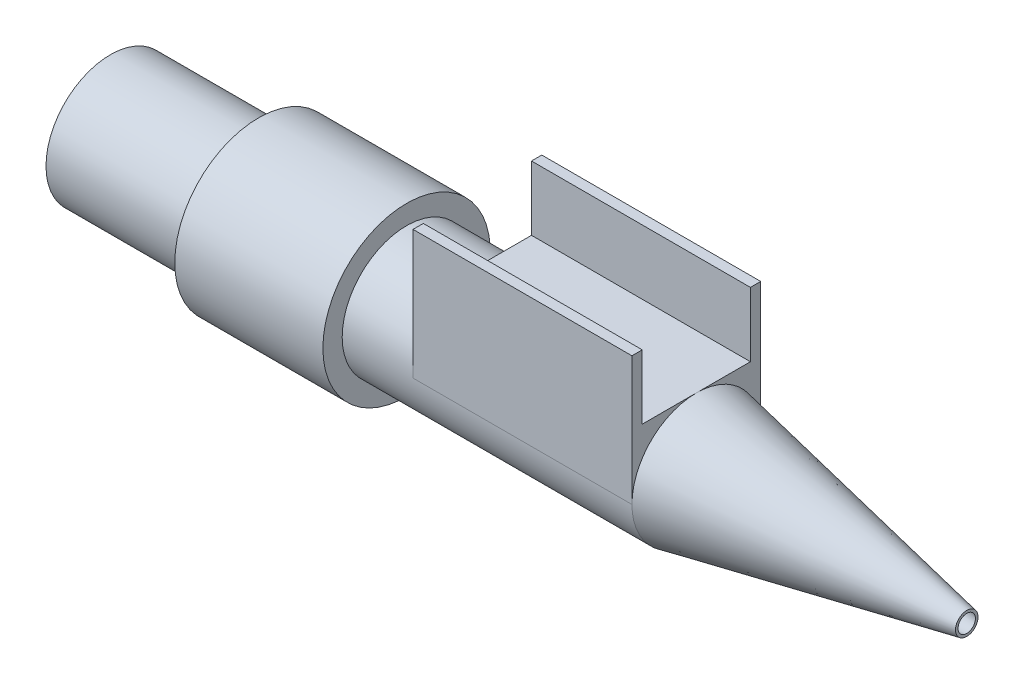
ISO-10303-21;
HEADER;
FILE_DESCRIPTION(('STEP AP214'),'2;1');
FILE_NAME('part.step','',(''),(''),'','','');
FILE_SCHEMA(('AUTOMOTIVE_DESIGN { 1 0 10303 214 1 1 1 1 }'));
ENDSEC;
DATA;
#1=APPLICATION_CONTEXT('core data for automotive mechanical design processes');
#2=APPLICATION_PROTOCOL_DEFINITION('international standard','automotive_design',2000,#1);
#3=PRODUCT_CONTEXT('',#1,'mechanical');
#4=PRODUCT('Part','Part','',(#3));
#5=PRODUCT_RELATED_PRODUCT_CATEGORY('part','',(#4));
#6=PRODUCT_DEFINITION_FORMATION('','',#4);
#7=PRODUCT_DEFINITION_CONTEXT('part definition',#1,'design');
#8=PRODUCT_DEFINITION('design','',#6,#7);
#9=PRODUCT_DEFINITION_SHAPE('','',#8);
#10=(LENGTH_UNIT() NAMED_UNIT(*) SI_UNIT(.MILLI.,.METRE.));
#11=(NAMED_UNIT(*) PLANE_ANGLE_UNIT() SI_UNIT($,.RADIAN.));
#12=(NAMED_UNIT(*) SI_UNIT($,.STERADIAN.) SOLID_ANGLE_UNIT());
#13=UNCERTAINTY_MEASURE_WITH_UNIT(LENGTH_MEASURE(1.E-05),#10,'distance_accuracy_value','');
#14=(GEOMETRIC_REPRESENTATION_CONTEXT(3) GLOBAL_UNCERTAINTY_ASSIGNED_CONTEXT((#13)) GLOBAL_UNIT_ASSIGNED_CONTEXT((#10,
#11,#12)) REPRESENTATION_CONTEXT('',''));
#15=CARTESIAN_POINT('',(0.,0.,0.));
#16=DIRECTION('',(0.,0.,1.));
#17=DIRECTION('',(1.,0.,0.));
#18=AXIS2_PLACEMENT_3D('',#15,#16,#17);
#19=CARTESIAN_POINT('',(0.,5.,0.));
#20=DIRECTION('',(0.,-1.,0.));
#21=DIRECTION('',(0.,0.,-1.));
#22=AXIS2_PLACEMENT_3D('',#19,#20,#21);
#23=PLANE('',#22);
#24=DIRECTION('',(1.,0.,0.));
#25=VECTOR('',#24,1.);
#26=CARTESIAN_POINT('',(45.5,5.,-4.2));
#27=LINE('',#26,#25);
#28=CARTESIAN_POINT('',(28.5,5.,-4.2));
#29=VERTEX_POINT('',#28);
#30=CARTESIAN_POINT('',(45.5,5.,-4.2));
#31=VERTEX_POINT('',#30);
#32=EDGE_CURVE('E56',#29,#31,#27,.T.);
#33=ORIENTED_EDGE('',*,*,#32,.F.);
#34=DIRECTION('',(0.,0.,1.));
#35=VECTOR('',#34,1.);
#36=CARTESIAN_POINT('',(28.5,5.,5.));
#37=LINE('',#36,#35);
#38=CARTESIAN_POINT('',(28.5,5.,0.));
#39=VERTEX_POINT('',#38);
#40=EDGE_CURVE('E135',#29,#39,#37,.T.);
#41=ORIENTED_EDGE('',*,*,#40,.T.);
#42=CARTESIAN_POINT('',(28.5,5.,4.2));
#43=VERTEX_POINT('',#42);
#44=EDGE_CURVE('E171',#39,#43,#37,.T.);
#45=ORIENTED_EDGE('',*,*,#44,.T.);
#46=DIRECTION('',(-1.,0.,0.));
#47=VECTOR('',#46,1.);
#48=CARTESIAN_POINT('',(45.5,5.,4.2));
#49=LINE('',#48,#47);
#50=CARTESIAN_POINT('',(45.5,5.,4.2));
#51=VERTEX_POINT('',#50);
#52=EDGE_CURVE('E137',#51,#43,#49,.T.);
#53=ORIENTED_EDGE('',*,*,#52,.F.);
#54=DIRECTION('',(0.,0.,-1.));
#55=VECTOR('',#54,1.);
#56=CARTESIAN_POINT('',(45.5,5.,-5.));
#57=LINE('',#56,#55);
#58=CARTESIAN_POINT('',(45.5,5.,-2.7678359782817E-11));
#59=VERTEX_POINT('',#58);
#60=EDGE_CURVE('E172',#51,#59,#57,.T.);
#61=ORIENTED_EDGE('',*,*,#60,.T.);
#62=EDGE_CURVE('E61',#59,#31,#57,.T.);
#63=ORIENTED_EDGE('',*,*,#62,.T.);
#64=EDGE_LOOP('',(#33,#41,#45,#53,#61,#63));
#65=FACE_BOUND('',#64,.T.);
#66=ADVANCED_FACE('F40',(#65),#23,.F.);
#67=CARTESIAN_POINT('',(0.,0.,0.));
#68=DIRECTION('',(-1.,0.,0.));
#69=DIRECTION('',(0.,0.,1.));
#70=AXIS2_PLACEMENT_3D('',#67,#68,#69);
#71=CYLINDRICAL_SURFACE('',#70,5.);
#72=CARTESIAN_POINT('',(23.,0.,0.));
#73=DIRECTION('',(-1.,0.,0.));
#74=DIRECTION('',(0.,0.,1.));
#75=AXIS2_PLACEMENT_3D('',#72,#73,#74);
#76=CIRCLE('',#75,5.);
#77=CARTESIAN_POINT('',(23.,0.,5.));
#78=VERTEX_POINT('',#77);
#79=EDGE_CURVE('E206',#78,#78,#76,.T.);
#80=ORIENTED_EDGE('',*,*,#79,.F.);
#81=EDGE_LOOP('',(#80));
#82=FACE_BOUND('',#81,.T.);
#83=CARTESIAN_POINT('',(28.5,0.,0.));
#84=DIRECTION('',(1.,0.,0.));
#85=DIRECTION('',(0.,0.,-1.));
#86=AXIS2_PLACEMENT_3D('',#83,#84,#85);
#87=CIRCLE('',#86,5.);
#88=CARTESIAN_POINT('',(28.5,0.,5.));
#89=VERTEX_POINT('',#88);
#90=EDGE_CURVE('E11',#39,#89,#87,.T.);
#91=ORIENTED_EDGE('',*,*,#90,.F.);
#92=CARTESIAN_POINT('',(28.5,0.,-5.));
#93=VERTEX_POINT('',#92);
#94=EDGE_CURVE('E44',#93,#39,#87,.T.);
#95=ORIENTED_EDGE('',*,*,#94,.F.);
#96=DIRECTION('',(-1.,0.,0.));
#97=VECTOR('',#96,1.);
#98=CARTESIAN_POINT('',(28.5,0.,-5.));
#99=LINE('',#98,#97);
#100=CARTESIAN_POINT('',(45.5,0.,-5.));
#101=VERTEX_POINT('',#100);
#102=EDGE_CURVE('E168',#101,#93,#99,.T.);
#103=ORIENTED_EDGE('',*,*,#102,.F.);
#104=CARTESIAN_POINT('',(45.5,0.,0.));
#105=DIRECTION('',(-1.,0.,0.));
#106=DIRECTION('',(0.,0.,1.));
#107=AXIS2_PLACEMENT_3D('',#104,#105,#106);
#108=CIRCLE('',#107,5.);
#109=CARTESIAN_POINT('',(45.5,0.,5.));
#110=VERTEX_POINT('',#109);
#111=EDGE_CURVE('E201',#101,#110,#108,.T.);
#112=ORIENTED_EDGE('',*,*,#111,.T.);
#113=DIRECTION('',(1.,0.,0.));
#114=VECTOR('',#113,1.);
#115=CARTESIAN_POINT('',(45.5,0.,5.));
#116=LINE('',#115,#114);
#117=EDGE_CURVE('E179',#89,#110,#116,.T.);
#118=ORIENTED_EDGE('',*,*,#117,.F.);
#119=EDGE_LOOP('',(#91,#95,#103,#112,#118));
#120=FACE_BOUND('',#119,.T.);
#121=ADVANCED_FACE('F282',(#82,#120),#71,.T.);
#122=CARTESIAN_POINT('',(0.,0.,0.));
#123=DIRECTION('',(1.,0.,0.));
#124=DIRECTION('',(0.,0.,-1.));
#125=AXIS2_PLACEMENT_3D('',#122,#123,#124);
#126=PLANE('',#125);
#127=CARTESIAN_POINT('',(0.,0.,0.));
#128=DIRECTION('',(-1.,0.,0.));
#129=DIRECTION('',(0.,0.,1.));
#130=AXIS2_PLACEMENT_3D('',#127,#128,#129);
#131=CIRCLE('',#130,3.5);
#132=CARTESIAN_POINT('',(0.,0.,3.5));
#133=VERTEX_POINT('',#132);
#134=EDGE_CURVE('E253',#133,#133,#131,.T.);
#135=ORIENTED_EDGE('',*,*,#134,.F.);
#136=EDGE_LOOP('',(#135));
#137=FACE_BOUND('',#136,.T.);
#138=CARTESIAN_POINT('',(0.,0.,0.));
#139=DIRECTION('',(-1.,0.,0.));
#140=DIRECTION('',(0.,0.,1.));
#141=AXIS2_PLACEMENT_3D('',#138,#139,#140);
#142=CIRCLE('',#141,5.);
#143=CARTESIAN_POINT('',(0.,0.,5.));
#144=VERTEX_POINT('',#143);
#145=EDGE_CURVE('E222',#144,#144,#142,.T.);
#146=ORIENTED_EDGE('',*,*,#145,.T.);
#147=EDGE_LOOP('',(#146));
#148=FACE_BOUND('',#147,.T.);
#149=ADVANCED_FACE('F42',(#137,#148),#126,.F.);
#150=CARTESIAN_POINT('',(0.,0.,0.));
#151=DIRECTION('',(-1.,0.,0.));
#152=DIRECTION('',(0.,0.,1.));
#153=AXIS2_PLACEMENT_3D('',#150,#151,#152);
#154=CYLINDRICAL_SURFACE('',#153,5.);
#155=ORIENTED_EDGE('',*,*,#145,.F.);
#156=EDGE_LOOP('',(#155));
#157=FACE_BOUND('',#156,.T.);
#158=CARTESIAN_POINT('',(11.5,0.,0.));
#159=DIRECTION('',(-1.,0.,0.));
#160=DIRECTION('',(0.,0.,1.));
#161=AXIS2_PLACEMENT_3D('',#158,#159,#160);
#162=CIRCLE('',#161,5.);
#163=CARTESIAN_POINT('',(11.5,0.,5.));
#164=VERTEX_POINT('',#163);
#165=EDGE_CURVE('E219',#164,#164,#162,.T.);
#166=ORIENTED_EDGE('',*,*,#165,.T.);
#167=EDGE_LOOP('',(#166));
#168=FACE_BOUND('',#167,.T.);
#169=ADVANCED_FACE('F320',(#157,#168),#154,.T.);
#170=CARTESIAN_POINT('',(11.5,5.,0.));
#171=DIRECTION('',(1.,0.,0.));
#172=DIRECTION('',(0.,0.,-1.));
#173=AXIS2_PLACEMENT_3D('',#170,#171,#172);
#174=PLANE('',#173);
#175=ORIENTED_EDGE('',*,*,#165,.F.);
#176=EDGE_LOOP('',(#175));
#177=FACE_BOUND('',#176,.T.);
#178=CARTESIAN_POINT('',(11.5,0.,0.));
#179=DIRECTION('',(-1.,0.,0.));
#180=DIRECTION('',(0.,0.,1.));
#181=AXIS2_PLACEMENT_3D('',#178,#179,#180);
#182=CIRCLE('',#181,6.5);
#183=CARTESIAN_POINT('',(11.5,0.,6.5));
#184=VERTEX_POINT('',#183);
#185=EDGE_CURVE('E215',#184,#184,#182,.T.);
#186=ORIENTED_EDGE('',*,*,#185,.T.);
#187=EDGE_LOOP('',(#186));
#188=FACE_BOUND('',#187,.T.);
#189=ADVANCED_FACE('F317',(#177,#188),#174,.F.);
#190=CARTESIAN_POINT('',(0.,0.,0.));
#191=DIRECTION('',(-1.,0.,0.));
#192=DIRECTION('',(0.,0.,1.));
#193=AXIS2_PLACEMENT_3D('',#190,#191,#192);
#194=CYLINDRICAL_SURFACE('',#193,6.5);
#195=ORIENTED_EDGE('',*,*,#185,.F.);
#196=EDGE_LOOP('',(#195));
#197=FACE_BOUND('',#196,.T.);
#198=CARTESIAN_POINT('',(23.,0.,0.));
#199=DIRECTION('',(-1.,0.,0.));
#200=DIRECTION('',(0.,0.,1.));
#201=AXIS2_PLACEMENT_3D('',#198,#199,#200);
#202=CIRCLE('',#201,6.5);
#203=CARTESIAN_POINT('',(23.,0.,6.5));
#204=VERTEX_POINT('',#203);
#205=EDGE_CURVE('E211',#204,#204,#202,.T.);
#206=ORIENTED_EDGE('',*,*,#205,.T.);
#207=EDGE_LOOP('',(#206));
#208=FACE_BOUND('',#207,.T.);
#209=ADVANCED_FACE('F313',(#197,#208),#194,.T.);
#210=CARTESIAN_POINT('',(23.,6.5,0.));
#211=DIRECTION('',(-1.,0.,0.));
#212=DIRECTION('',(0.,0.,1.));
#213=AXIS2_PLACEMENT_3D('',#210,#211,#212);
#214=PLANE('',#213);
#215=ORIENTED_EDGE('',*,*,#205,.F.);
#216=EDGE_LOOP('',(#215));
#217=FACE_BOUND('',#216,.T.);
#218=ORIENTED_EDGE('',*,*,#79,.T.);
#219=EDGE_LOOP('',(#218));
#220=FACE_BOUND('',#219,.T.);
#221=ADVANCED_FACE('F309',(#217,#220),#214,.F.);
#222=CARTESIAN_POINT('',(66.5,0.,0.));
#223=DIRECTION('',(-1.,0.,0.));
#224=DIRECTION('',(0.,0.,1.));
#225=AXIS2_PLACEMENT_3D('',#222,#223,#224);
#226=CONICAL_SURFACE('',#225,0.875,0.193959147259893);
#227=EDGE_CURVE('E202',#110,#59,#108,.T.);
#228=ORIENTED_EDGE('',*,*,#227,.F.);
#229=ORIENTED_EDGE('',*,*,#111,.F.);
#230=EDGE_CURVE('E207',#59,#101,#108,.T.);
#231=ORIENTED_EDGE('',*,*,#230,.F.);
#232=EDGE_LOOP('',(#228,#229,#231));
#233=FACE_BOUND('',#232,.T.);
#234=CARTESIAN_POINT('',(66.5,0.,0.));
#235=DIRECTION('',(-1.,0.,0.));
#236=DIRECTION('',(0.,0.,1.));
#237=AXIS2_PLACEMENT_3D('',#234,#235,#236);
#238=CIRCLE('',#237,0.875);
#239=CARTESIAN_POINT('',(66.5,0.,0.875));
#240=VERTEX_POINT('',#239);
#241=EDGE_CURVE('E197',#240,#240,#238,.T.);
#242=ORIENTED_EDGE('',*,*,#241,.T.);
#243=EDGE_LOOP('',(#242));
#244=FACE_BOUND('',#243,.T.);
#245=ADVANCED_FACE('F307',(#233,#244),#226,.T.);
#246=CARTESIAN_POINT('',(66.5,0.875,0.));
#247=DIRECTION('',(-1.,0.,0.));
#248=DIRECTION('',(0.,0.,1.));
#249=AXIS2_PLACEMENT_3D('',#246,#247,#248);
#250=PLANE('',#249);
#251=CARTESIAN_POINT('',(66.5,0.,0.));
#252=DIRECTION('',(-1.,0.,0.));
#253=DIRECTION('',(0.,0.,1.));
#254=AXIS2_PLACEMENT_3D('',#251,#252,#253);
#255=CIRCLE('',#254,0.675);
#256=CARTESIAN_POINT('',(66.5,0.,0.675));
#257=VERTEX_POINT('',#256);
#258=EDGE_CURVE('E262',#257,#257,#255,.T.);
#259=ORIENTED_EDGE('',*,*,#258,.T.);
#260=EDGE_LOOP('',(#259));
#261=FACE_BOUND('',#260,.T.);
#262=ORIENTED_EDGE('',*,*,#241,.F.);
#263=EDGE_LOOP('',(#262));
#264=FACE_BOUND('',#263,.T.);
#265=ADVANCED_FACE('F269',(#261,#264),#250,.F.);
#266=CARTESIAN_POINT('',(28.5,5.,5.));
#267=DIRECTION('',(1.,0.,0.));
#268=DIRECTION('',(0.,0.,-1.));
#269=AXIS2_PLACEMENT_3D('',#266,#267,#268);
#270=PLANE('',#269);
#271=DIRECTION('',(0.,-1.,0.));
#272=VECTOR('',#271,1.);
#273=CARTESIAN_POINT('',(28.5,5.,-5.));
#274=LINE('',#273,#272);
#275=CARTESIAN_POINT('',(28.5,10.,-5.));
#276=VERTEX_POINT('',#275);
#277=EDGE_CURVE('E194',#276,#93,#274,.T.);
#278=ORIENTED_EDGE('',*,*,#277,.T.);
#279=ORIENTED_EDGE('',*,*,#94,.T.);
#280=ORIENTED_EDGE('',*,*,#40,.F.);
#281=DIRECTION('',(0.,-1.,0.));
#282=VECTOR('',#281,1.);
#283=CARTESIAN_POINT('',(28.5,10.,-4.2));
#284=LINE('',#283,#282);
#285=CARTESIAN_POINT('',(28.5,10.,-4.2));
#286=VERTEX_POINT('',#285);
#287=EDGE_CURVE('E114',#286,#29,#284,.T.);
#288=ORIENTED_EDGE('',*,*,#287,.F.);
#289=DIRECTION('',(0.,0.,1.));
#290=VECTOR('',#289,1.);
#291=CARTESIAN_POINT('',(28.5,10.,-4.2));
#292=LINE('',#291,#290);
#293=EDGE_CURVE('E122',#276,#286,#292,.T.);
#294=ORIENTED_EDGE('',*,*,#293,.F.);
#295=EDGE_LOOP('',(#278,#279,#280,#288,#294));
#296=FACE_BOUND('',#295,.T.);
#297=ADVANCED_FACE('F133',(#296),#270,.F.);
#298=CARTESIAN_POINT('',(45.5,5.,-5.));
#299=DIRECTION('',(-1.,0.,0.));
#300=DIRECTION('',(0.,0.,1.));
#301=AXIS2_PLACEMENT_3D('',#298,#299,#300);
#302=PLANE('',#301);
#303=DIRECTION('',(0.,-1.,0.));
#304=VECTOR('',#303,1.);
#305=CARTESIAN_POINT('',(45.5,5.,5.));
#306=LINE('',#305,#304);
#307=CARTESIAN_POINT('',(45.5,10.,5.));
#308=VERTEX_POINT('',#307);
#309=EDGE_CURVE('E186',#308,#110,#306,.T.);
#310=ORIENTED_EDGE('',*,*,#309,.T.);
#311=ORIENTED_EDGE('',*,*,#227,.T.);
#312=ORIENTED_EDGE('',*,*,#60,.F.);
#313=DIRECTION('',(0.,-1.,0.));
#314=VECTOR('',#313,1.);
#315=CARTESIAN_POINT('',(45.5,10.,4.2));
#316=LINE('',#315,#314);
#317=CARTESIAN_POINT('',(45.5,10.,4.2));
#318=VERTEX_POINT('',#317);
#319=EDGE_CURVE('E164',#318,#51,#316,.T.);
#320=ORIENTED_EDGE('',*,*,#319,.F.);
#321=DIRECTION('',(0.,0.,-1.));
#322=VECTOR('',#321,1.);
#323=CARTESIAN_POINT('',(45.5,10.,5.));
#324=LINE('',#323,#322);
#325=EDGE_CURVE('E154',#308,#318,#324,.T.);
#326=ORIENTED_EDGE('',*,*,#325,.F.);
#327=EDGE_LOOP('',(#310,#311,#312,#320,#326));
#328=FACE_BOUND('',#327,.T.);
#329=ADVANCED_FACE('F297',(#328),#302,.F.);
#330=CARTESIAN_POINT('',(28.5,5.,-5.));
#331=DIRECTION('',(0.,0.,1.));
#332=DIRECTION('',(1.,0.,0.));
#333=AXIS2_PLACEMENT_3D('',#330,#331,#332);
#334=PLANE('',#333);
#335=ORIENTED_EDGE('',*,*,#102,.T.);
#336=ORIENTED_EDGE('',*,*,#277,.F.);
#337=DIRECTION('',(-1.,0.,0.));
#338=VECTOR('',#337,1.);
#339=CARTESIAN_POINT('',(28.5,10.,-5.));
#340=LINE('',#339,#338);
#341=CARTESIAN_POINT('',(45.5,10.,-5.));
#342=VERTEX_POINT('',#341);
#343=EDGE_CURVE('E128',#342,#276,#340,.T.);
#344=ORIENTED_EDGE('',*,*,#343,.F.);
#345=DIRECTION('',(0.,-1.,0.));
#346=VECTOR('',#345,1.);
#347=CARTESIAN_POINT('',(45.5,5.,-5.));
#348=LINE('',#347,#346);
#349=EDGE_CURVE('E175',#342,#101,#348,.T.);
#350=ORIENTED_EDGE('',*,*,#349,.T.);
#351=EDGE_LOOP('',(#335,#336,#344,#350));
#352=FACE_BOUND('',#351,.T.);
#353=ADVANCED_FACE('F247',(#352),#334,.F.);
#354=ORIENTED_EDGE('',*,*,#44,.F.);
#355=ORIENTED_EDGE('',*,*,#90,.T.);
#356=DIRECTION('',(0.,-1.,0.));
#357=VECTOR('',#356,1.);
#358=CARTESIAN_POINT('',(28.5,5.,5.));
#359=LINE('',#358,#357);
#360=CARTESIAN_POINT('',(28.5,10.,5.));
#361=VERTEX_POINT('',#360);
#362=EDGE_CURVE('E190',#361,#89,#359,.T.);
#363=ORIENTED_EDGE('',*,*,#362,.F.);
#364=DIRECTION('',(0.,0.,1.));
#365=VECTOR('',#364,1.);
#366=CARTESIAN_POINT('',(28.5,10.,4.2));
#367=LINE('',#366,#365);
#368=CARTESIAN_POINT('',(28.5,10.,4.2));
#369=VERTEX_POINT('',#368);
#370=EDGE_CURVE('E142',#369,#361,#367,.T.);
#371=ORIENTED_EDGE('',*,*,#370,.F.);
#372=DIRECTION('',(0.,-1.,0.));
#373=VECTOR('',#372,1.);
#374=CARTESIAN_POINT('',(28.5,10.,4.2));
#375=LINE('',#374,#373);
#376=EDGE_CURVE('E159',#369,#43,#375,.T.);
#377=ORIENTED_EDGE('',*,*,#376,.T.);
#378=EDGE_LOOP('',(#354,#355,#363,#371,#377));
#379=FACE_BOUND('',#378,.T.);
#380=ADVANCED_FACE('F233',(#379),#270,.F.);
#381=CARTESIAN_POINT('',(45.5,5.,5.));
#382=DIRECTION('',(0.,0.,-1.));
#383=DIRECTION('',(-1.,0.,0.));
#384=AXIS2_PLACEMENT_3D('',#381,#382,#383);
#385=PLANE('',#384);
#386=ORIENTED_EDGE('',*,*,#117,.T.);
#387=ORIENTED_EDGE('',*,*,#309,.F.);
#388=DIRECTION('',(1.,0.,0.));
#389=VECTOR('',#388,1.);
#390=CARTESIAN_POINT('',(28.5,10.,5.));
#391=LINE('',#390,#389);
#392=EDGE_CURVE('E150',#361,#308,#391,.T.);
#393=ORIENTED_EDGE('',*,*,#392,.F.);
#394=ORIENTED_EDGE('',*,*,#362,.T.);
#395=EDGE_LOOP('',(#386,#387,#393,#394));
#396=FACE_BOUND('',#395,.T.);
#397=ADVANCED_FACE('F296',(#396),#385,.F.);
#398=ORIENTED_EDGE('',*,*,#62,.F.);
#399=ORIENTED_EDGE('',*,*,#230,.T.);
#400=ORIENTED_EDGE('',*,*,#349,.F.);
#401=DIRECTION('',(0.,0.,-1.));
#402=VECTOR('',#401,1.);
#403=CARTESIAN_POINT('',(45.5,10.,-5.));
#404=LINE('',#403,#402);
#405=CARTESIAN_POINT('',(45.5,10.,-4.2));
#406=VERTEX_POINT('',#405);
#407=EDGE_CURVE('E121',#406,#342,#404,.T.);
#408=ORIENTED_EDGE('',*,*,#407,.F.);
#409=DIRECTION('',(0.,-1.,0.));
#410=VECTOR('',#409,1.);
#411=CARTESIAN_POINT('',(45.5,10.,-4.2));
#412=LINE('',#411,#410);
#413=EDGE_CURVE('E116',#406,#31,#412,.T.);
#414=ORIENTED_EDGE('',*,*,#413,.T.);
#415=EDGE_LOOP('',(#398,#399,#400,#408,#414));
#416=FACE_BOUND('',#415,.T.);
#417=ADVANCED_FACE('F243',(#416),#302,.F.);
#418=CARTESIAN_POINT('',(45.5,10.,4.2));
#419=DIRECTION('',(0.,0.,1.));
#420=DIRECTION('',(1.,0.,0.));
#421=AXIS2_PLACEMENT_3D('',#418,#419,#420);
#422=PLANE('',#421);
#423=ORIENTED_EDGE('',*,*,#52,.T.);
#424=ORIENTED_EDGE('',*,*,#376,.F.);
#425=DIRECTION('',(-1.,0.,0.));
#426=VECTOR('',#425,1.);
#427=CARTESIAN_POINT('',(45.5,10.,4.2));
#428=LINE('',#427,#426);
#429=EDGE_CURVE('E157',#318,#369,#428,.T.);
#430=ORIENTED_EDGE('',*,*,#429,.F.);
#431=ORIENTED_EDGE('',*,*,#319,.T.);
#432=EDGE_LOOP('',(#423,#424,#430,#431));
#433=FACE_BOUND('',#432,.T.);
#434=ADVANCED_FACE('F292',(#433),#422,.F.);
#435=CARTESIAN_POINT('',(0.,10.,0.));
#436=DIRECTION('',(0.,1.,0.));
#437=DIRECTION('',(0.,0.,1.));
#438=AXIS2_PLACEMENT_3D('',#435,#436,#437);
#439=PLANE('',#438);
#440=ORIENTED_EDGE('',*,*,#370,.T.);
#441=ORIENTED_EDGE('',*,*,#392,.T.);
#442=ORIENTED_EDGE('',*,*,#325,.T.);
#443=ORIENTED_EDGE('',*,*,#429,.T.);
#444=EDGE_LOOP('',(#440,#441,#442,#443));
#445=FACE_BOUND('',#444,.T.);
#446=ADVANCED_FACE('F343',(#445),#439,.T.);
#447=CARTESIAN_POINT('',(45.5,10.,-4.2));
#448=DIRECTION('',(0.,0.,-1.));
#449=DIRECTION('',(-1.,0.,0.));
#450=AXIS2_PLACEMENT_3D('',#447,#448,#449);
#451=PLANE('',#450);
#452=ORIENTED_EDGE('',*,*,#32,.T.);
#453=ORIENTED_EDGE('',*,*,#413,.F.);
#454=DIRECTION('',(1.,0.,0.));
#455=VECTOR('',#454,1.);
#456=CARTESIAN_POINT('',(45.5,10.,-4.2));
#457=LINE('',#456,#455);
#458=EDGE_CURVE('E110',#286,#406,#457,.T.);
#459=ORIENTED_EDGE('',*,*,#458,.F.);
#460=ORIENTED_EDGE('',*,*,#287,.T.);
#461=EDGE_LOOP('',(#452,#453,#459,#460));
#462=FACE_BOUND('',#461,.T.);
#463=ADVANCED_FACE('F112',(#462),#451,.F.);
#464=CARTESIAN_POINT('',(0.,10.,0.));
#465=DIRECTION('',(0.,-1.,0.));
#466=DIRECTION('',(0.,0.,-1.));
#467=AXIS2_PLACEMENT_3D('',#464,#465,#466);
#468=PLANE('',#467);
#469=ORIENTED_EDGE('',*,*,#293,.T.);
#470=ORIENTED_EDGE('',*,*,#458,.T.);
#471=ORIENTED_EDGE('',*,*,#407,.T.);
#472=ORIENTED_EDGE('',*,*,#343,.T.);
#473=EDGE_LOOP('',(#469,#470,#471,#472));
#474=FACE_BOUND('',#473,.T.);
#475=ADVANCED_FACE('F126',(#474),#468,.F.);
#476=CARTESIAN_POINT('',(0.,0.,0.));
#477=DIRECTION('',(-1.,0.,0.));
#478=DIRECTION('',(0.,0.,1.));
#479=AXIS2_PLACEMENT_3D('',#476,#477,#478);
#480=CYLINDRICAL_SURFACE('',#479,3.5);
#481=ORIENTED_EDGE('',*,*,#134,.T.);
#482=EDGE_LOOP('',(#481));
#483=FACE_BOUND('',#482,.T.);
#484=CARTESIAN_POINT('',(45.5,0.,0.));
#485=DIRECTION('',(-1.,0.,0.));
#486=DIRECTION('',(0.,0.,1.));
#487=AXIS2_PLACEMENT_3D('',#484,#485,#486);
#488=CIRCLE('',#487,3.5);
#489=CARTESIAN_POINT('',(45.5,0.,3.5));
#490=VERTEX_POINT('',#489);
#491=EDGE_CURVE('E256',#490,#490,#488,.T.);
#492=ORIENTED_EDGE('',*,*,#491,.F.);
#493=EDGE_LOOP('',(#492));
#494=FACE_BOUND('',#493,.T.);
#495=ADVANCED_FACE('F274',(#483,#494),#480,.F.);
#496=CARTESIAN_POINT('',(66.5,0.,0.));
#497=DIRECTION('',(-1.,0.,0.));
#498=DIRECTION('',(0.,0.,1.));
#499=AXIS2_PLACEMENT_3D('',#496,#497,#498);
#500=CONICAL_SURFACE('',#499,0.675,0.133721031217722);
#501=ORIENTED_EDGE('',*,*,#491,.T.);
#502=EDGE_LOOP('',(#501));
#503=FACE_BOUND('',#502,.T.);
#504=ORIENTED_EDGE('',*,*,#258,.F.);
#505=EDGE_LOOP('',(#504));
#506=FACE_BOUND('',#505,.T.);
#507=ADVANCED_FACE('F272',(#503,#506),#500,.F.);
#508=CLOSED_SHELL('',(#66,#121,#149,#169,#189,#209,#221,#245,#265,#297,#329,#353,#380,#397,#417,
#434,#446,#463,#475,#495,#507));
#509=MANIFOLD_SOLID_BREP('B2',#508);
#510=ADVANCED_BREP_SHAPE_REPRESENTATION('',(#18,#509),#14);
#511=SHAPE_DEFINITION_REPRESENTATION(#9,#510);
ENDSEC;
END-ISO-10303-21;
